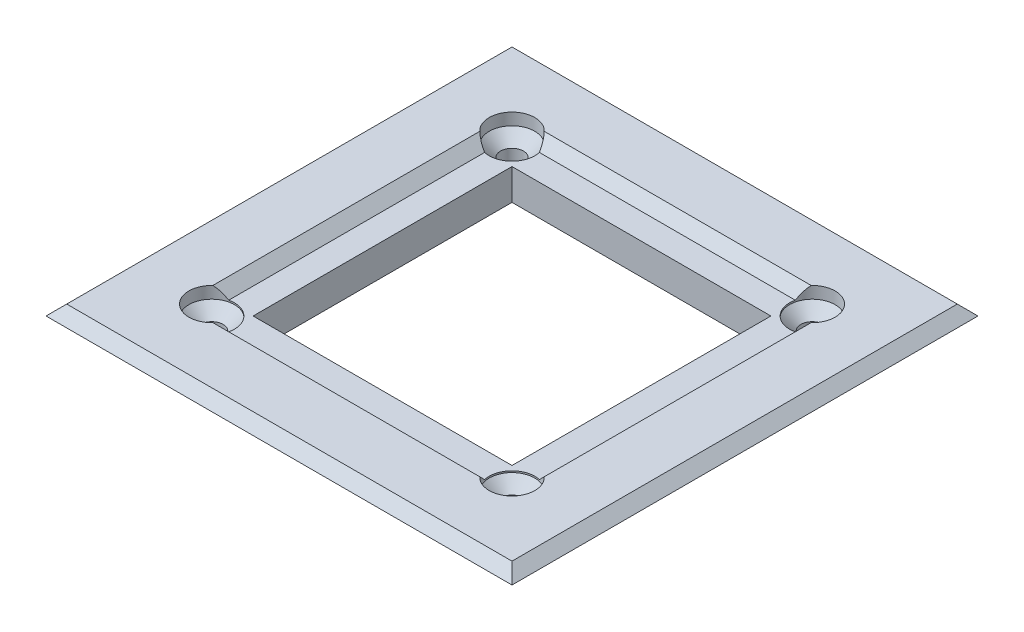
ISO-10303-21;
HEADER;
FILE_DESCRIPTION(('STEP AP214'),'2;1');
FILE_NAME('part.step','',(''),(''),'','','');
FILE_SCHEMA(('AUTOMOTIVE_DESIGN { 1 0 10303 214 1 1 1 1 }'));
ENDSEC;
DATA;
#1=APPLICATION_CONTEXT('core data for automotive mechanical design processes');
#2=APPLICATION_PROTOCOL_DEFINITION('international standard','automotive_design',2000,#1);
#3=PRODUCT_CONTEXT('',#1,'mechanical');
#4=PRODUCT('Part','Part','',(#3));
#5=PRODUCT_RELATED_PRODUCT_CATEGORY('part','',(#4));
#6=PRODUCT_DEFINITION_FORMATION('','',#4);
#7=PRODUCT_DEFINITION_CONTEXT('part definition',#1,'design');
#8=PRODUCT_DEFINITION('design','',#6,#7);
#9=PRODUCT_DEFINITION_SHAPE('','',#8);
#10=(LENGTH_UNIT() NAMED_UNIT(*) SI_UNIT(.MILLI.,.METRE.));
#11=(NAMED_UNIT(*) PLANE_ANGLE_UNIT() SI_UNIT($,.RADIAN.));
#12=(NAMED_UNIT(*) SI_UNIT($,.STERADIAN.) SOLID_ANGLE_UNIT());
#13=UNCERTAINTY_MEASURE_WITH_UNIT(LENGTH_MEASURE(1.E-05),#10,'distance_accuracy_value','');
#14=(GEOMETRIC_REPRESENTATION_CONTEXT(3) GLOBAL_UNCERTAINTY_ASSIGNED_CONTEXT((#13)) GLOBAL_UNIT_ASSIGNED_CONTEXT((#10,
#11,#12)) REPRESENTATION_CONTEXT('',''));
#15=CARTESIAN_POINT('',(0.,0.,0.));
#16=DIRECTION('',(0.,0.,1.));
#17=DIRECTION('',(1.,0.,0.));
#18=AXIS2_PLACEMENT_3D('',#15,#16,#17);
#19=CARTESIAN_POINT('',(0.,4.,0.));
#20=DIRECTION('',(0.,-1.,0.));
#21=DIRECTION('',(0.,0.,-1.));
#22=AXIS2_PLACEMENT_3D('',#19,#20,#21);
#23=PLANE('',#22);
#24=DIRECTION('',(0.,0.,1.));
#25=VECTOR('',#24,1.);
#26=CARTESIAN_POINT('',(-21.5,4.,0.));
#27=LINE('',#26,#25);
#28=CARTESIAN_POINT('',(-21.5,4.,-21.5));
#29=VERTEX_POINT('',#28);
#30=CARTESIAN_POINT('',(-21.5,4.,21.5));
#31=VERTEX_POINT('',#30);
#32=EDGE_CURVE('E50',#29,#31,#27,.T.);
#33=ORIENTED_EDGE('',*,*,#32,.T.);
#34=DIRECTION('',(1.,0.,0.));
#35=VECTOR('',#34,1.);
#36=CARTESIAN_POINT('',(0.,4.,21.5));
#37=LINE('',#36,#35);
#38=CARTESIAN_POINT('',(21.5,4.,21.5));
#39=VERTEX_POINT('',#38);
#40=EDGE_CURVE('E299',#31,#39,#37,.T.);
#41=ORIENTED_EDGE('',*,*,#40,.T.);
#42=DIRECTION('',(0.,0.,-1.));
#43=VECTOR('',#42,1.);
#44=CARTESIAN_POINT('',(21.5,4.,0.));
#45=LINE('',#44,#43);
#46=CARTESIAN_POINT('',(21.5,4.,-21.5));
#47=VERTEX_POINT('',#46);
#48=EDGE_CURVE('E295',#39,#47,#45,.T.);
#49=ORIENTED_EDGE('',*,*,#48,.T.);
#50=DIRECTION('',(-1.,0.,0.));
#51=VECTOR('',#50,1.);
#52=CARTESIAN_POINT('',(0.,4.,-21.5));
#53=LINE('',#52,#51);
#54=EDGE_CURVE('E55',#47,#29,#53,.T.);
#55=ORIENTED_EDGE('',*,*,#54,.T.);
#56=EDGE_LOOP('',(#33,#41,#49,#55));
#57=FACE_BOUND('',#56,.T.);
#58=CARTESIAN_POINT('',(-14.5,4.,-14.4999999999992));
#59=DIRECTION('',(0.,-1.,0.));
#60=DIRECTION('',(0.,0.,-1.));
#61=AXIS2_PLACEMENT_3D('',#58,#59,#60);
#62=CIRCLE('',#61,2.20000000000088);
#63=CARTESIAN_POINT('',(-12.8906523060565,4.,-16.));
#64=VERTEX_POINT('',#63);
#65=CARTESIAN_POINT('',(-16.,4.,-12.8906523060549));
#66=VERTEX_POINT('',#65);
#67=EDGE_CURVE('E179',#64,#66,#62,.F.);
#68=ORIENTED_EDGE('',*,*,#67,.F.);
#69=DIRECTION('',(1.,0.,0.));
#70=VECTOR('',#69,1.);
#71=CARTESIAN_POINT('',(15.,4.,-16.));
#72=LINE('',#71,#70);
#73=CARTESIAN_POINT('',(12.8906523060569,4.,-16.));
#74=VERTEX_POINT('',#73);
#75=EDGE_CURVE('E11',#64,#74,#72,.T.);
#76=ORIENTED_EDGE('',*,*,#75,.T.);
#77=CARTESIAN_POINT('',(14.5,4.,-14.5));
#78=DIRECTION('',(0.,-1.,0.));
#79=DIRECTION('',(0.,0.,-1.));
#80=AXIS2_PLACEMENT_3D('',#77,#78,#79);
#81=CIRCLE('',#80,2.2);
#82=CARTESIAN_POINT('',(16.,4.,-12.8906523060569));
#83=VERTEX_POINT('',#82);
#84=EDGE_CURVE('E698',#83,#74,#81,.F.);
#85=ORIENTED_EDGE('',*,*,#84,.F.);
#86=DIRECTION('',(0.,0.,1.));
#87=VECTOR('',#86,1.);
#88=CARTESIAN_POINT('',(16.,4.,15.));
#89=LINE('',#88,#87);
#90=CARTESIAN_POINT('',(16.,4.,12.8906523060564));
#91=VERTEX_POINT('',#90);
#92=EDGE_CURVE('E301',#83,#91,#89,.T.);
#93=ORIENTED_EDGE('',*,*,#92,.T.);
#94=CARTESIAN_POINT('',(14.5000000000008,4.,14.5));
#95=DIRECTION('',(0.,-1.,0.));
#96=DIRECTION('',(0.,0.,-1.));
#97=AXIS2_PLACEMENT_3D('',#94,#95,#96);
#98=CIRCLE('',#97,2.1999999999998);
#99=CARTESIAN_POINT('',(12.890652306058,4.,16.));
#100=VERTEX_POINT('',#99);
#101=EDGE_CURVE('E688',#100,#91,#98,.F.);
#102=ORIENTED_EDGE('',*,*,#101,.F.);
#103=DIRECTION('',(-1.,0.,0.));
#104=VECTOR('',#103,1.);
#105=CARTESIAN_POINT('',(-15.,4.,16.));
#106=LINE('',#105,#104);
#107=CARTESIAN_POINT('',(-12.8906523060545,4.,16.));
#108=VERTEX_POINT('',#107);
#109=EDGE_CURVE('E304',#100,#108,#106,.T.);
#110=ORIENTED_EDGE('',*,*,#109,.T.);
#111=CARTESIAN_POINT('',(-14.4999999999992,4.,14.5000000000008));
#112=DIRECTION('',(0.,-1.,0.));
#113=DIRECTION('',(0.,0.,-1.));
#114=AXIS2_PLACEMENT_3D('',#111,#112,#113);
#115=CIRCLE('',#114,2.2000000000006);
#116=CARTESIAN_POINT('',(-16.,4.,12.8906523060576));
#117=VERTEX_POINT('',#116);
#118=EDGE_CURVE('E691',#117,#108,#115,.F.);
#119=ORIENTED_EDGE('',*,*,#118,.F.);
#120=DIRECTION('',(0.,0.,-1.));
#121=VECTOR('',#120,1.);
#122=CARTESIAN_POINT('',(-16.,4.,-15.));
#123=LINE('',#122,#121);
#124=EDGE_CURVE('E42',#117,#66,#123,.T.);
#125=ORIENTED_EDGE('',*,*,#124,.T.);
#126=EDGE_LOOP('',(#68,#76,#85,#93,#102,#110,#119,#125));
#127=FACE_BOUND('',#126,.T.);
#128=ADVANCED_FACE('F33',(#57,#127),#23,.F.);
#129=CARTESIAN_POINT('',(-15.,2.99999999999999,15.));
#130=DIRECTION('',(0.707106781186547,0.707106781186547,0.));
#131=DIRECTION('',(0.,0.,-1.));
#132=AXIS2_PLACEMENT_3D('',#129,#130,#131);
#133=PLANE('',#132);
#134=DIRECTION('',(0.,0.,1.));
#135=VECTOR('',#134,1.);
#136=CARTESIAN_POINT('',(-15.,3.,15.));
#137=LINE('',#136,#135);
#138=CARTESIAN_POINT('',(-15.,3.,-12.3575714714373));
#139=VERTEX_POINT('',#138);
#140=CARTESIAN_POINT('',(-14.9999999999999,3.,12.3575714714375));
#141=VERTEX_POINT('',#140);
#142=EDGE_CURVE('E191',#139,#141,#137,.T.);
#143=ORIENTED_EDGE('',*,*,#142,.F.);
#144=CARTESIAN_POINT('',(-14.5,2.5,-14.4999999999992));
#145=DIRECTION('',(0.707106781186547,0.707106781186547,0.));
#146=DIRECTION('',(0.707106781186548,-0.707106781186548,0.));
#147=AXIS2_PLACEMENT_3D('',#144,#145,#146);
#148=ELLIPSE('',#147,3.11126983722205,2.20000000000088);
#149=EDGE_CURVE('E196',#139,#66,#148,.F.);
#150=ORIENTED_EDGE('',*,*,#149,.T.);
#151=ORIENTED_EDGE('',*,*,#124,.F.);
#152=CARTESIAN_POINT('',(-14.4999999999992,2.49999999999919,14.5000000000008));
#153=DIRECTION('',(0.707106781186547,0.707106781186547,0.));
#154=DIRECTION('',(0.707106781186548,-0.707106781186548,0.));
#155=AXIS2_PLACEMENT_3D('',#152,#153,#154);
#156=ELLIPSE('',#155,3.11126983722166,2.2000000000006);
#157=EDGE_CURVE('E737',#117,#141,#156,.F.);
#158=ORIENTED_EDGE('',*,*,#157,.T.);
#159=EDGE_LOOP('',(#143,#150,#151,#158));
#160=FACE_BOUND('',#159,.T.);
#161=ADVANCED_FACE('F359',(#160),#133,.T.);
#162=CARTESIAN_POINT('',(-15.,2.99999999999999,-15.));
#163=DIRECTION('',(0.,0.707106781186547,0.707106781186547));
#164=DIRECTION('',(1.,0.,0.));
#165=AXIS2_PLACEMENT_3D('',#162,#163,#164);
#166=PLANE('',#165);
#167=ORIENTED_EDGE('',*,*,#75,.F.);
#168=CARTESIAN_POINT('',(-14.5,2.49999999999918,-14.4999999999992));
#169=DIRECTION('',(0.,0.707106781186547,0.707106781186547));
#170=DIRECTION('',(0.,-0.707106781186548,0.707106781186548));
#171=AXIS2_PLACEMENT_3D('',#168,#169,#170);
#172=ELLIPSE('',#171,3.11126983722205,2.20000000000088);
#173=CARTESIAN_POINT('',(-12.3575714714365,3.,-15.0000000000001));
#174=VERTEX_POINT('',#173);
#175=EDGE_CURVE('E171',#64,#174,#172,.F.);
#176=ORIENTED_EDGE('',*,*,#175,.T.);
#177=DIRECTION('',(-1.,0.,0.));
#178=VECTOR('',#177,1.);
#179=CARTESIAN_POINT('',(-15.,3.,-15.));
#180=LINE('',#179,#178);
#181=CARTESIAN_POINT('',(12.3575714714371,3.,-15.));
#182=VERTEX_POINT('',#181);
#183=EDGE_CURVE('E175',#182,#174,#180,.T.);
#184=ORIENTED_EDGE('',*,*,#183,.F.);
#185=CARTESIAN_POINT('',(14.5,2.5,-14.5));
#186=DIRECTION('',(0.,0.707106781186547,0.707106781186547));
#187=DIRECTION('',(0.,-0.707106781186548,0.707106781186548));
#188=AXIS2_PLACEMENT_3D('',#185,#186,#187);
#189=ELLIPSE('',#188,3.11126983722081,2.2);
#190=EDGE_CURVE('E696',#182,#74,#189,.F.);
#191=ORIENTED_EDGE('',*,*,#190,.T.);
#192=EDGE_LOOP('',(#167,#176,#184,#191));
#193=FACE_BOUND('',#192,.T.);
#194=ADVANCED_FACE('F173',(#193),#166,.T.);
#195=CARTESIAN_POINT('',(-15.,2.99999999999999,15.));
#196=DIRECTION('',(0.,0.707106781186548,-0.707106781186547));
#197=DIRECTION('',(-1.,0.,0.));
#198=AXIS2_PLACEMENT_3D('',#195,#196,#197);
#199=PLANE('',#198);
#200=DIRECTION('',(1.,0.,0.));
#201=VECTOR('',#200,1.);
#202=CARTESIAN_POINT('',(-15.,3.,15.));
#203=LINE('',#202,#201);
#204=CARTESIAN_POINT('',(-12.3575714714373,3.,15.));
#205=VERTEX_POINT('',#204);
#206=CARTESIAN_POINT('',(12.3575714714381,3.,14.9999999999998));
#207=VERTEX_POINT('',#206);
#208=EDGE_CURVE('E215',#205,#207,#203,.T.);
#209=ORIENTED_EDGE('',*,*,#208,.F.);
#210=CARTESIAN_POINT('',(-14.4999999999992,2.5000000000008,14.5000000000008));
#211=DIRECTION('',(0.,0.707106781186548,-0.707106781186547));
#212=DIRECTION('',(0.,-0.707106781186547,-0.707106781186548));
#213=AXIS2_PLACEMENT_3D('',#210,#211,#212);
#214=ELLIPSE('',#213,3.11126983722166,2.2000000000006);
#215=EDGE_CURVE('E687',#205,#108,#214,.F.);
#216=ORIENTED_EDGE('',*,*,#215,.T.);
#217=ORIENTED_EDGE('',*,*,#109,.F.);
#218=CARTESIAN_POINT('',(14.5000000000008,2.49999999999999,14.5));
#219=DIRECTION('',(0.,0.707106781186548,-0.707106781186547));
#220=DIRECTION('',(0.,-0.707106781186547,-0.707106781186548));
#221=AXIS2_PLACEMENT_3D('',#218,#219,#220);
#222=ELLIPSE('',#221,3.11126983722052,2.1999999999998);
#223=EDGE_CURVE('E678',#100,#207,#222,.F.);
#224=ORIENTED_EDGE('',*,*,#223,.T.);
#225=EDGE_LOOP('',(#209,#216,#217,#224));
#226=FACE_BOUND('',#225,.T.);
#227=ADVANCED_FACE('F417',(#226),#199,.T.);
#228=CARTESIAN_POINT('',(15.,2.99999999999999,15.));
#229=DIRECTION('',(-0.707106781186547,0.707106781186547,0.));
#230=DIRECTION('',(0.,0.,1.));
#231=AXIS2_PLACEMENT_3D('',#228,#229,#230);
#232=PLANE('',#231);
#233=DIRECTION('',(0.,0.,-1.));
#234=VECTOR('',#233,1.);
#235=CARTESIAN_POINT('',(15.,3.,15.));
#236=LINE('',#235,#234);
#237=CARTESIAN_POINT('',(15.,3.,12.3575714714372));
#238=VERTEX_POINT('',#237);
#239=CARTESIAN_POINT('',(15.,3.,-12.3575714714371));
#240=VERTEX_POINT('',#239);
#241=EDGE_CURVE('E192',#238,#240,#236,.T.);
#242=ORIENTED_EDGE('',*,*,#241,.F.);
#243=CARTESIAN_POINT('',(14.5000000000008,2.5000000000008,14.5));
#244=DIRECTION('',(-0.707106781186547,0.707106781186547,0.));
#245=DIRECTION('',(-0.707106781186548,-0.707106781186548,0.));
#246=AXIS2_PLACEMENT_3D('',#243,#244,#245);
#247=ELLIPSE('',#246,3.11126983722052,2.1999999999998);
#248=EDGE_CURVE('E681',#238,#91,#247,.F.);
#249=ORIENTED_EDGE('',*,*,#248,.T.);
#250=ORIENTED_EDGE('',*,*,#92,.F.);
#251=CARTESIAN_POINT('',(14.5,2.49999999999999,-14.5));
#252=DIRECTION('',(-0.707106781186547,0.707106781186547,0.));
#253=DIRECTION('',(-0.707106781186548,-0.707106781186548,0.));
#254=AXIS2_PLACEMENT_3D('',#251,#252,#253);
#255=ELLIPSE('',#254,3.11126983722081,2.2);
#256=EDGE_CURVE('E701',#83,#240,#255,.F.);
#257=ORIENTED_EDGE('',*,*,#256,.T.);
#258=EDGE_LOOP('',(#242,#249,#250,#257));
#259=FACE_BOUND('',#258,.T.);
#260=ADVANCED_FACE('F396',(#259),#232,.T.);
#261=CARTESIAN_POINT('',(0.,3.,0.));
#262=DIRECTION('',(0.,-1.,0.));
#263=DIRECTION('',(0.,0.,-1.));
#264=AXIS2_PLACEMENT_3D('',#261,#262,#263);
#265=PLANE('',#264);
#266=DIRECTION('',(-1.,0.,0.));
#267=VECTOR('',#266,1.);
#268=CARTESIAN_POINT('',(-12.5,3.,-12.5));
#269=LINE('',#268,#267);
#270=CARTESIAN_POINT('',(12.5,3.,-12.5));
#271=VERTEX_POINT('',#270);
#272=CARTESIAN_POINT('',(-12.5,3.,-12.5));
#273=VERTEX_POINT('',#272);
#274=EDGE_CURVE('E246',#271,#273,#269,.T.);
#275=ORIENTED_EDGE('',*,*,#274,.F.);
#276=DIRECTION('',(0.,0.,-1.));
#277=VECTOR('',#276,1.);
#278=CARTESIAN_POINT('',(12.5,3.,12.5));
#279=LINE('',#278,#277);
#280=CARTESIAN_POINT('',(12.5,3.,12.5));
#281=VERTEX_POINT('',#280);
#282=EDGE_CURVE('E230',#281,#271,#279,.T.);
#283=ORIENTED_EDGE('',*,*,#282,.F.);
#284=DIRECTION('',(1.,0.,0.));
#285=VECTOR('',#284,1.);
#286=CARTESIAN_POINT('',(-12.5,3.,12.5));
#287=LINE('',#286,#285);
#288=CARTESIAN_POINT('',(-12.5,3.,12.5));
#289=VERTEX_POINT('',#288);
#290=EDGE_CURVE('E235',#289,#281,#287,.T.);
#291=ORIENTED_EDGE('',*,*,#290,.F.);
#292=DIRECTION('',(0.,0.,1.));
#293=VECTOR('',#292,1.);
#294=CARTESIAN_POINT('',(-12.5,3.,12.5));
#295=LINE('',#294,#293);
#296=EDGE_CURVE('E249',#273,#289,#295,.T.);
#297=ORIENTED_EDGE('',*,*,#296,.F.);
#298=EDGE_LOOP('',(#275,#283,#291,#297));
#299=FACE_BOUND('',#298,.T.);
#300=ORIENTED_EDGE('',*,*,#241,.T.);
#301=CARTESIAN_POINT('',(14.5,3.,-14.5));
#302=DIRECTION('',(0.,1.,0.));
#303=DIRECTION('',(0.,0.,1.));
#304=AXIS2_PLACEMENT_3D('',#301,#302,#303);
#305=CIRCLE('',#304,2.2);
#306=EDGE_CURVE('E190',#182,#240,#305,.T.);
#307=ORIENTED_EDGE('',*,*,#306,.F.);
#308=ORIENTED_EDGE('',*,*,#183,.T.);
#309=CARTESIAN_POINT('',(-14.4999999999998,3.,-14.5000000000002));
#310=DIRECTION('',(0.,1.,0.));
#311=DIRECTION('',(0.,0.,1.));
#312=AXIS2_PLACEMENT_3D('',#309,#310,#311);
#313=CIRCLE('',#312,2.2);
#314=EDGE_CURVE('E187',#139,#174,#313,.T.);
#315=ORIENTED_EDGE('',*,*,#314,.F.);
#316=ORIENTED_EDGE('',*,*,#142,.T.);
#317=CARTESIAN_POINT('',(-14.5000000000001,3.,14.4999999999999));
#318=DIRECTION('',(0.,1.,0.));
#319=DIRECTION('',(0.,0.,1.));
#320=AXIS2_PLACEMENT_3D('',#317,#318,#319);
#321=CIRCLE('',#320,2.2);
#322=EDGE_CURVE('E321',#205,#141,#321,.T.);
#323=ORIENTED_EDGE('',*,*,#322,.F.);
#324=ORIENTED_EDGE('',*,*,#208,.T.);
#325=CARTESIAN_POINT('',(14.5,3.,14.5));
#326=DIRECTION('',(0.,1.,0.));
#327=DIRECTION('',(0.,0.,1.));
#328=AXIS2_PLACEMENT_3D('',#325,#326,#327);
#329=CIRCLE('',#328,2.2);
#330=EDGE_CURVE('E334',#238,#207,#329,.T.);
#331=ORIENTED_EDGE('',*,*,#330,.F.);
#332=EDGE_LOOP('',(#300,#307,#308,#315,#316,#323,#324,#331));
#333=FACE_BOUND('',#332,.T.);
#334=ADVANCED_FACE('F185',(#299,#333),#265,.F.);
#335=CARTESIAN_POINT('',(17.5,3.,17.5));
#336=DIRECTION('',(-1.,0.,0.));
#337=DIRECTION('',(0.,0.,1.));
#338=AXIS2_PLACEMENT_3D('',#335,#336,#337);
#339=PLANE('',#338);
#340=DIRECTION('',(0.,0.,-1.));
#341=VECTOR('',#340,1.);
#342=CARTESIAN_POINT('',(17.5,0.,17.5));
#343=LINE('',#342,#341);
#344=CARTESIAN_POINT('',(17.5,0.,17.5));
#345=VERTEX_POINT('',#344);
#346=CARTESIAN_POINT('',(17.5,0.,-17.5));
#347=VERTEX_POINT('',#346);
#348=EDGE_CURVE('E256',#345,#347,#343,.T.);
#349=ORIENTED_EDGE('',*,*,#348,.T.);
#350=DIRECTION('',(0.,-1.,0.));
#351=VECTOR('',#350,1.);
#352=CARTESIAN_POINT('',(17.5,3.,-17.5));
#353=LINE('',#352,#351);
#354=CARTESIAN_POINT('',(17.5,3.,-17.5));
#355=VERTEX_POINT('',#354);
#356=EDGE_CURVE('E292',#355,#347,#353,.T.);
#357=ORIENTED_EDGE('',*,*,#356,.F.);
#358=DIRECTION('',(0.,0.,-1.));
#359=VECTOR('',#358,1.);
#360=CARTESIAN_POINT('',(17.5,3.,17.5));
#361=LINE('',#360,#359);
#362=CARTESIAN_POINT('',(17.5,3.,17.5));
#363=VERTEX_POINT('',#362);
#364=EDGE_CURVE('E263',#363,#355,#361,.T.);
#365=ORIENTED_EDGE('',*,*,#364,.F.);
#366=DIRECTION('',(0.,-1.,0.));
#367=VECTOR('',#366,1.);
#368=CARTESIAN_POINT('',(17.5,3.,17.5));
#369=LINE('',#368,#367);
#370=EDGE_CURVE('E276',#363,#345,#369,.T.);
#371=ORIENTED_EDGE('',*,*,#370,.T.);
#372=EDGE_LOOP('',(#349,#357,#365,#371));
#373=FACE_BOUND('',#372,.T.);
#374=ADVANCED_FACE('F395',(#373),#339,.F.);
#375=CARTESIAN_POINT('',(-17.5,3.,-17.5));
#376=DIRECTION('',(0.,0.,1.));
#377=DIRECTION('',(1.,0.,0.));
#378=AXIS2_PLACEMENT_3D('',#375,#376,#377);
#379=PLANE('',#378);
#380=DIRECTION('',(-1.,0.,0.));
#381=VECTOR('',#380,1.);
#382=CARTESIAN_POINT('',(-17.5,0.,-17.5));
#383=LINE('',#382,#381);
#384=CARTESIAN_POINT('',(-17.5,0.,-17.5));
#385=VERTEX_POINT('',#384);
#386=EDGE_CURVE('E279',#347,#385,#383,.T.);
#387=ORIENTED_EDGE('',*,*,#386,.T.);
#388=DIRECTION('',(0.,-1.,0.));
#389=VECTOR('',#388,1.);
#390=CARTESIAN_POINT('',(-17.5,3.,-17.5));
#391=LINE('',#390,#389);
#392=CARTESIAN_POINT('',(-17.5,3.,-17.5));
#393=VERTEX_POINT('',#392);
#394=EDGE_CURVE('E289',#393,#385,#391,.T.);
#395=ORIENTED_EDGE('',*,*,#394,.F.);
#396=DIRECTION('',(-1.,0.,0.));
#397=VECTOR('',#396,1.);
#398=CARTESIAN_POINT('',(-17.5,3.,-17.5));
#399=LINE('',#398,#397);
#400=EDGE_CURVE('E266',#355,#393,#399,.T.);
#401=ORIENTED_EDGE('',*,*,#400,.F.);
#402=ORIENTED_EDGE('',*,*,#356,.T.);
#403=EDGE_LOOP('',(#387,#395,#401,#402));
#404=FACE_BOUND('',#403,.T.);
#405=ADVANCED_FACE('F408',(#404),#379,.F.);
#406=CARTESIAN_POINT('',(-17.5,3.,17.5));
#407=DIRECTION('',(1.,0.,0.));
#408=DIRECTION('',(0.,0.,-1.));
#409=AXIS2_PLACEMENT_3D('',#406,#407,#408);
#410=PLANE('',#409);
#411=DIRECTION('',(0.,0.,1.));
#412=VECTOR('',#411,1.);
#413=CARTESIAN_POINT('',(-17.5,0.,17.5));
#414=LINE('',#413,#412);
#415=CARTESIAN_POINT('',(-17.5,0.,17.5));
#416=VERTEX_POINT('',#415);
#417=EDGE_CURVE('E281',#385,#416,#414,.T.);
#418=ORIENTED_EDGE('',*,*,#417,.T.);
#419=DIRECTION('',(0.,-1.,0.));
#420=VECTOR('',#419,1.);
#421=CARTESIAN_POINT('',(-17.5,3.,17.5));
#422=LINE('',#421,#420);
#423=CARTESIAN_POINT('',(-17.5,3.,17.5));
#424=VERTEX_POINT('',#423);
#425=EDGE_CURVE('E286',#424,#416,#422,.T.);
#426=ORIENTED_EDGE('',*,*,#425,.F.);
#427=DIRECTION('',(0.,0.,1.));
#428=VECTOR('',#427,1.);
#429=CARTESIAN_POINT('',(-17.5,3.,17.5));
#430=LINE('',#429,#428);
#431=EDGE_CURVE('E270',#393,#424,#430,.T.);
#432=ORIENTED_EDGE('',*,*,#431,.F.);
#433=ORIENTED_EDGE('',*,*,#394,.T.);
#434=EDGE_LOOP('',(#418,#426,#432,#433));
#435=FACE_BOUND('',#434,.T.);
#436=ADVANCED_FACE('F404',(#435),#410,.F.);
#437=CARTESIAN_POINT('',(-17.5,3.,17.5));
#438=DIRECTION('',(0.,0.,-1.));
#439=DIRECTION('',(-1.,0.,0.));
#440=AXIS2_PLACEMENT_3D('',#437,#438,#439);
#441=PLANE('',#440);
#442=DIRECTION('',(1.,0.,0.));
#443=VECTOR('',#442,1.);
#444=CARTESIAN_POINT('',(-17.5,0.,17.5));
#445=LINE('',#444,#443);
#446=EDGE_CURVE('E267',#416,#345,#445,.T.);
#447=ORIENTED_EDGE('',*,*,#446,.T.);
#448=ORIENTED_EDGE('',*,*,#370,.F.);
#449=DIRECTION('',(1.,0.,0.));
#450=VECTOR('',#449,1.);
#451=CARTESIAN_POINT('',(-17.5,3.,17.5));
#452=LINE('',#451,#450);
#453=EDGE_CURVE('E273',#424,#363,#452,.T.);
#454=ORIENTED_EDGE('',*,*,#453,.F.);
#455=ORIENTED_EDGE('',*,*,#425,.T.);
#456=EDGE_LOOP('',(#447,#448,#454,#455));
#457=FACE_BOUND('',#456,.T.);
#458=ADVANCED_FACE('F400',(#457),#441,.F.);
#459=CARTESIAN_POINT('',(0.,0.,0.));
#460=DIRECTION('',(0.,-1.,0.));
#461=DIRECTION('',(0.,0.,-1.));
#462=AXIS2_PLACEMENT_3D('',#459,#460,#461);
#463=PLANE('',#462);
#464=CARTESIAN_POINT('',(14.5,0.,-14.5));
#465=DIRECTION('',(0.,-1.,0.));
#466=DIRECTION('',(0.,0.,-1.));
#467=AXIS2_PLACEMENT_3D('',#464,#465,#466);
#468=CIRCLE('',#467,1.1);
#469=CARTESIAN_POINT('',(14.5,0.,-15.6));
#470=VERTEX_POINT('',#469);
#471=EDGE_CURVE('E37',#470,#470,#468,.T.);
#472=ORIENTED_EDGE('',*,*,#471,.F.);
#473=EDGE_LOOP('',(#472));
#474=FACE_BOUND('',#473,.T.);
#475=CARTESIAN_POINT('',(14.5,0.,14.5));
#476=DIRECTION('',(0.,-1.,0.));
#477=DIRECTION('',(0.,0.,-1.));
#478=AXIS2_PLACEMENT_3D('',#475,#476,#477);
#479=CIRCLE('',#478,1.1);
#480=CARTESIAN_POINT('',(14.5,0.,13.4000000000001));
#481=VERTEX_POINT('',#480);
#482=EDGE_CURVE('E319',#481,#481,#479,.T.);
#483=ORIENTED_EDGE('',*,*,#482,.F.);
#484=EDGE_LOOP('',(#483));
#485=FACE_BOUND('',#484,.T.);
#486=CARTESIAN_POINT('',(-14.5000000000001,0.,14.4999999999999));
#487=DIRECTION('',(0.,-1.,0.));
#488=DIRECTION('',(0.,0.,-1.));
#489=AXIS2_PLACEMENT_3D('',#486,#487,#488);
#490=CIRCLE('',#489,1.1);
#491=CARTESIAN_POINT('',(-14.5000000000001,0.,13.3999999999999));
#492=VERTEX_POINT('',#491);
#493=EDGE_CURVE('E198',#492,#492,#490,.T.);
#494=ORIENTED_EDGE('',*,*,#493,.F.);
#495=EDGE_LOOP('',(#494));
#496=FACE_BOUND('',#495,.T.);
#497=CARTESIAN_POINT('',(-14.4999999999998,0.,-14.5000000000002));
#498=DIRECTION('',(0.,-1.,0.));
#499=DIRECTION('',(0.,0.,-1.));
#500=AXIS2_PLACEMENT_3D('',#497,#498,#499);
#501=CIRCLE('',#500,1.1);
#502=CARTESIAN_POINT('',(-14.4999999999998,0.,-15.6000000000002));
#503=VERTEX_POINT('',#502);
#504=EDGE_CURVE('E211',#503,#503,#501,.T.);
#505=ORIENTED_EDGE('',*,*,#504,.F.);
#506=EDGE_LOOP('',(#505));
#507=FACE_BOUND('',#506,.T.);
#508=DIRECTION('',(0.,0.,-1.));
#509=VECTOR('',#508,1.);
#510=CARTESIAN_POINT('',(12.5,0.,12.5));
#511=LINE('',#510,#509);
#512=CARTESIAN_POINT('',(12.5,0.,12.5));
#513=VERTEX_POINT('',#512);
#514=CARTESIAN_POINT('',(12.5,0.,-12.5));
#515=VERTEX_POINT('',#514);
#516=EDGE_CURVE('E231',#513,#515,#511,.T.);
#517=ORIENTED_EDGE('',*,*,#516,.T.);
#518=DIRECTION('',(-1.,0.,0.));
#519=VECTOR('',#518,1.);
#520=CARTESIAN_POINT('',(-12.5,0.,-12.5));
#521=LINE('',#520,#519);
#522=CARTESIAN_POINT('',(-12.5,0.,-12.5));
#523=VERTEX_POINT('',#522);
#524=EDGE_CURVE('E234',#515,#523,#521,.T.);
#525=ORIENTED_EDGE('',*,*,#524,.T.);
#526=DIRECTION('',(0.,0.,1.));
#527=VECTOR('',#526,1.);
#528=CARTESIAN_POINT('',(-12.5,0.,12.5));
#529=LINE('',#528,#527);
#530=CARTESIAN_POINT('',(-12.5,0.,12.5));
#531=VERTEX_POINT('',#530);
#532=EDGE_CURVE('E238',#523,#531,#529,.T.);
#533=ORIENTED_EDGE('',*,*,#532,.T.);
#534=DIRECTION('',(1.,0.,0.));
#535=VECTOR('',#534,1.);
#536=CARTESIAN_POINT('',(-12.5,0.,12.5));
#537=LINE('',#536,#535);
#538=EDGE_CURVE('E241',#531,#513,#537,.T.);
#539=ORIENTED_EDGE('',*,*,#538,.T.);
#540=EDGE_LOOP('',(#517,#525,#533,#539));
#541=FACE_BOUND('',#540,.T.);
#542=ORIENTED_EDGE('',*,*,#348,.F.);
#543=ORIENTED_EDGE('',*,*,#446,.F.);
#544=ORIENTED_EDGE('',*,*,#417,.F.);
#545=ORIENTED_EDGE('',*,*,#386,.F.);
#546=EDGE_LOOP('',(#542,#543,#544,#545));
#547=FACE_BOUND('',#546,.T.);
#548=ADVANCED_FACE('F391',(#474,#485,#496,#507,#541,#547),#463,.T.);
#549=CARTESIAN_POINT('',(12.5,0.,12.5));
#550=DIRECTION('',(1.,0.,0.));
#551=DIRECTION('',(0.,0.,-1.));
#552=AXIS2_PLACEMENT_3D('',#549,#550,#551);
#553=PLANE('',#552);
#554=ORIENTED_EDGE('',*,*,#282,.T.);
#555=DIRECTION('',(0.,1.,0.));
#556=VECTOR('',#555,1.);
#557=CARTESIAN_POINT('',(12.5,0.,-12.5));
#558=LINE('',#557,#556);
#559=EDGE_CURVE('E244',#515,#271,#558,.T.);
#560=ORIENTED_EDGE('',*,*,#559,.F.);
#561=ORIENTED_EDGE('',*,*,#516,.F.);
#562=DIRECTION('',(0.,1.,0.));
#563=VECTOR('',#562,1.);
#564=CARTESIAN_POINT('',(12.5,0.,12.5));
#565=LINE('',#564,#563);
#566=EDGE_CURVE('E254',#513,#281,#565,.T.);
#567=ORIENTED_EDGE('',*,*,#566,.T.);
#568=EDGE_LOOP('',(#554,#560,#561,#567));
#569=FACE_BOUND('',#568,.T.);
#570=ADVANCED_FACE('F381',(#569),#553,.F.);
#571=CARTESIAN_POINT('',(-12.5,0.,12.5));
#572=DIRECTION('',(0.,0.,1.));
#573=DIRECTION('',(1.,0.,0.));
#574=AXIS2_PLACEMENT_3D('',#571,#572,#573);
#575=PLANE('',#574);
#576=ORIENTED_EDGE('',*,*,#290,.T.);
#577=ORIENTED_EDGE('',*,*,#566,.F.);
#578=ORIENTED_EDGE('',*,*,#538,.F.);
#579=DIRECTION('',(0.,1.,0.));
#580=VECTOR('',#579,1.);
#581=CARTESIAN_POINT('',(-12.5,0.,12.5));
#582=LINE('',#581,#580);
#583=EDGE_CURVE('E257',#531,#289,#582,.T.);
#584=ORIENTED_EDGE('',*,*,#583,.T.);
#585=EDGE_LOOP('',(#576,#577,#578,#584));
#586=FACE_BOUND('',#585,.T.);
#587=ADVANCED_FACE('F377',(#586),#575,.F.);
#588=CARTESIAN_POINT('',(-12.5,0.,12.5));
#589=DIRECTION('',(-1.,0.,0.));
#590=DIRECTION('',(0.,0.,1.));
#591=AXIS2_PLACEMENT_3D('',#588,#589,#590);
#592=PLANE('',#591);
#593=ORIENTED_EDGE('',*,*,#296,.T.);
#594=ORIENTED_EDGE('',*,*,#583,.F.);
#595=ORIENTED_EDGE('',*,*,#532,.F.);
#596=DIRECTION('',(0.,1.,0.));
#597=VECTOR('',#596,1.);
#598=CARTESIAN_POINT('',(-12.5,0.,-12.5));
#599=LINE('',#598,#597);
#600=EDGE_CURVE('E259',#523,#273,#599,.T.);
#601=ORIENTED_EDGE('',*,*,#600,.T.);
#602=EDGE_LOOP('',(#593,#594,#595,#601));
#603=FACE_BOUND('',#602,.T.);
#604=ADVANCED_FACE('F380',(#603),#592,.F.);
#605=CARTESIAN_POINT('',(-12.5,0.,-12.5));
#606=DIRECTION('',(0.,0.,-1.));
#607=DIRECTION('',(-1.,0.,0.));
#608=AXIS2_PLACEMENT_3D('',#605,#606,#607);
#609=PLANE('',#608);
#610=ORIENTED_EDGE('',*,*,#274,.T.);
#611=ORIENTED_EDGE('',*,*,#600,.F.);
#612=ORIENTED_EDGE('',*,*,#524,.F.);
#613=ORIENTED_EDGE('',*,*,#559,.T.);
#614=EDGE_LOOP('',(#610,#611,#612,#613));
#615=FACE_BOUND('',#614,.T.);
#616=ADVANCED_FACE('F375',(#615),#609,.F.);
#617=CARTESIAN_POINT('',(0.,3.,0.));
#618=DIRECTION('',(0.,-1.,0.));
#619=DIRECTION('',(0.,0.,-1.));
#620=AXIS2_PLACEMENT_3D('',#617,#618,#619);
#621=PLANE('',#620);
#622=DIRECTION('',(0.,0.,-1.));
#623=VECTOR('',#622,1.);
#624=CARTESIAN_POINT('',(22.5,3.,22.5));
#625=LINE('',#624,#623);
#626=CARTESIAN_POINT('',(22.5,3.,22.5));
#627=VERTEX_POINT('',#626);
#628=CARTESIAN_POINT('',(22.5,3.,-22.5));
#629=VERTEX_POINT('',#628);
#630=EDGE_CURVE('E218',#627,#629,#625,.T.);
#631=ORIENTED_EDGE('',*,*,#630,.F.);
#632=DIRECTION('',(1.,0.,0.));
#633=VECTOR('',#632,1.);
#634=CARTESIAN_POINT('',(-22.5,3.,22.5));
#635=LINE('',#634,#633);
#636=CARTESIAN_POINT('',(-22.5,3.,22.5));
#637=VERTEX_POINT('',#636);
#638=EDGE_CURVE('E227',#637,#627,#635,.T.);
#639=ORIENTED_EDGE('',*,*,#638,.F.);
#640=DIRECTION('',(0.,0.,1.));
#641=VECTOR('',#640,1.);
#642=CARTESIAN_POINT('',(-22.5,3.,22.5));
#643=LINE('',#642,#641);
#644=CARTESIAN_POINT('',(-22.5,3.,-22.5));
#645=VERTEX_POINT('',#644);
#646=EDGE_CURVE('E224',#645,#637,#643,.T.);
#647=ORIENTED_EDGE('',*,*,#646,.F.);
#648=DIRECTION('',(-1.,0.,0.));
#649=VECTOR('',#648,1.);
#650=CARTESIAN_POINT('',(-22.5,3.,-22.5));
#651=LINE('',#650,#649);
#652=EDGE_CURVE('E221',#629,#645,#651,.T.);
#653=ORIENTED_EDGE('',*,*,#652,.F.);
#654=EDGE_LOOP('',(#631,#639,#647,#653));
#655=FACE_BOUND('',#654,.T.);
#656=ORIENTED_EDGE('',*,*,#364,.T.);
#657=ORIENTED_EDGE('',*,*,#400,.T.);
#658=ORIENTED_EDGE('',*,*,#431,.T.);
#659=ORIENTED_EDGE('',*,*,#453,.T.);
#660=EDGE_LOOP('',(#656,#657,#658,#659));
#661=FACE_BOUND('',#660,.T.);
#662=ADVANCED_FACE('F372',(#655,#661),#621,.T.);
#663=CARTESIAN_POINT('',(0.,4.,-21.5));
#664=DIRECTION('',(0.,-0.707106781186547,0.707106781186547));
#665=DIRECTION('',(-1.,0.,0.));
#666=AXIS2_PLACEMENT_3D('',#663,#664,#665);
#667=PLANE('',#666);
#668=DIRECTION('',(-0.577350269189626,0.577350269189626,0.577350269189626));
#669=VECTOR('',#668,1.);
#670=CARTESIAN_POINT('',(14.3333333333333,11.1666666666667,-14.3333333333333));
#671=LINE('',#670,#669);
#672=EDGE_CURVE('E313',#629,#47,#671,.T.);
#673=ORIENTED_EDGE('',*,*,#672,.F.);
#674=ORIENTED_EDGE('',*,*,#652,.T.);
#675=DIRECTION('',(0.577350269189626,0.577350269189626,0.577350269189626));
#676=VECTOR('',#675,1.);
#677=CARTESIAN_POINT('',(-14.3333333333333,11.1666666666667,-14.3333333333333));
#678=LINE('',#677,#676);
#679=EDGE_CURVE('E212',#29,#645,#678,.F.);
#680=ORIENTED_EDGE('',*,*,#679,.F.);
#681=ORIENTED_EDGE('',*,*,#54,.F.);
#682=EDGE_LOOP('',(#673,#674,#680,#681));
#683=FACE_BOUND('',#682,.T.);
#684=ADVANCED_FACE('F35',(#683),#667,.F.);
#685=CARTESIAN_POINT('',(-21.5,4.,0.));
#686=DIRECTION('',(0.707106781186547,-0.707106781186547,0.));
#687=DIRECTION('',(0.,0.,1.));
#688=AXIS2_PLACEMENT_3D('',#685,#686,#687);
#689=PLANE('',#688);
#690=ORIENTED_EDGE('',*,*,#679,.T.);
#691=ORIENTED_EDGE('',*,*,#646,.T.);
#692=DIRECTION('',(0.577350269189626,0.577350269189626,-0.577350269189626));
#693=VECTOR('',#692,1.);
#694=CARTESIAN_POINT('',(-14.3333333333333,11.1666666666667,14.3333333333333));
#695=LINE('',#694,#693);
#696=EDGE_CURVE('E311',#31,#637,#695,.F.);
#697=ORIENTED_EDGE('',*,*,#696,.F.);
#698=ORIENTED_EDGE('',*,*,#32,.F.);
#699=EDGE_LOOP('',(#690,#691,#697,#698));
#700=FACE_BOUND('',#699,.T.);
#701=ADVANCED_FACE('F431',(#700),#689,.F.);
#702=CARTESIAN_POINT('',(21.5,4.,0.));
#703=DIRECTION('',(-0.707106781186547,-0.707106781186547,0.));
#704=DIRECTION('',(0.,0.,-1.));
#705=AXIS2_PLACEMENT_3D('',#702,#703,#704);
#706=PLANE('',#705);
#707=ORIENTED_EDGE('',*,*,#672,.T.);
#708=ORIENTED_EDGE('',*,*,#48,.F.);
#709=DIRECTION('',(0.577350269189626,-0.577350269189626,0.577350269189626));
#710=VECTOR('',#709,1.);
#711=CARTESIAN_POINT('',(14.3333333333333,11.1666666666667,14.3333333333333));
#712=LINE('',#711,#710);
#713=EDGE_CURVE('E309',#627,#39,#712,.F.);
#714=ORIENTED_EDGE('',*,*,#713,.F.);
#715=ORIENTED_EDGE('',*,*,#630,.T.);
#716=EDGE_LOOP('',(#707,#708,#714,#715));
#717=FACE_BOUND('',#716,.T.);
#718=ADVANCED_FACE('F428',(#717),#706,.F.);
#719=CARTESIAN_POINT('',(0.,4.,21.5));
#720=DIRECTION('',(0.,-0.707106781186547,-0.707106781186547));
#721=DIRECTION('',(1.,0.,0.));
#722=AXIS2_PLACEMENT_3D('',#719,#720,#721);
#723=PLANE('',#722);
#724=ORIENTED_EDGE('',*,*,#696,.T.);
#725=ORIENTED_EDGE('',*,*,#638,.T.);
#726=ORIENTED_EDGE('',*,*,#713,.T.);
#727=ORIENTED_EDGE('',*,*,#40,.F.);
#728=EDGE_LOOP('',(#724,#725,#726,#727));
#729=FACE_BOUND('',#728,.T.);
#730=ADVANCED_FACE('F425',(#729),#723,.F.);
#731=CARTESIAN_POINT('',(-14.4999999999998,3.,-14.5000000000002));
#732=DIRECTION('',(0.,1.,0.));
#733=DIRECTION('',(0.,0.,1.));
#734=AXIS2_PLACEMENT_3D('',#731,#732,#733);
#735=CYLINDRICAL_SURFACE('',#734,1.1);
#736=ORIENTED_EDGE('',*,*,#504,.T.);
#737=EDGE_LOOP('',(#736));
#738=FACE_BOUND('',#737,.T.);
#739=CARTESIAN_POINT('',(-14.4999999999998,1.75,-14.5000000000002));
#740=DIRECTION('',(0.,1.,0.));
#741=DIRECTION('',(0.,0.,1.));
#742=AXIS2_PLACEMENT_3D('',#739,#740,#741);
#743=CIRCLE('',#742,1.1);
#744=CARTESIAN_POINT('',(-14.4999999999998,1.75,-13.4000000000001));
#745=VERTEX_POINT('',#744);
#746=EDGE_CURVE('E201',#745,#745,#743,.T.);
#747=ORIENTED_EDGE('',*,*,#746,.T.);
#748=EDGE_LOOP('',(#747));
#749=FACE_BOUND('',#748,.T.);
#750=ADVANCED_FACE('F370',(#738,#749),#735,.F.);
#751=CARTESIAN_POINT('',(-14.4999999999998,2.85,-14.5000000000002));
#752=DIRECTION('',(0.,1.,0.));
#753=DIRECTION('',(0.,0.,1.));
#754=AXIS2_PLACEMENT_3D('',#751,#752,#753);
#755=CONICAL_SURFACE('',#754,2.2,0.785398163397447);
#756=ORIENTED_EDGE('',*,*,#746,.F.);
#757=EDGE_LOOP('',(#756));
#758=FACE_BOUND('',#757,.T.);
#759=CARTESIAN_POINT('',(-14.4999999999998,2.85,-14.5000000000002));
#760=DIRECTION('',(0.,1.,0.));
#761=DIRECTION('',(0.,0.,1.));
#762=AXIS2_PLACEMENT_3D('',#759,#760,#761);
#763=CIRCLE('',#762,2.2);
#764=CARTESIAN_POINT('',(-14.4999999999998,2.85,-12.3000000000002));
#765=VERTEX_POINT('',#764);
#766=EDGE_CURVE('E197',#765,#765,#763,.T.);
#767=ORIENTED_EDGE('',*,*,#766,.T.);
#768=EDGE_LOOP('',(#767));
#769=FACE_BOUND('',#768,.T.);
#770=ADVANCED_FACE('F518',(#758,#769),#755,.F.);
#771=CARTESIAN_POINT('',(-14.4999999999998,3.,-14.5000000000002));
#772=DIRECTION('',(0.,1.,0.));
#773=DIRECTION('',(0.,0.,1.));
#774=AXIS2_PLACEMENT_3D('',#771,#772,#773);
#775=CYLINDRICAL_SURFACE('',#774,2.2);
#776=ORIENTED_EDGE('',*,*,#766,.F.);
#777=EDGE_LOOP('',(#776));
#778=FACE_BOUND('',#777,.T.);
#779=ORIENTED_EDGE('',*,*,#314,.T.);
#780=ORIENTED_EDGE('',*,*,#175,.F.);
#781=ORIENTED_EDGE('',*,*,#67,.T.);
#782=ORIENTED_EDGE('',*,*,#149,.F.);
#783=EDGE_LOOP('',(#779,#780,#781,#782));
#784=FACE_BOUND('',#783,.T.);
#785=ADVANCED_FACE('F194',(#778,#784),#775,.F.);
#786=CARTESIAN_POINT('',(-14.5000000000001,3.,14.4999999999999));
#787=DIRECTION('',(0.,1.,0.));
#788=DIRECTION('',(0.,0.,1.));
#789=AXIS2_PLACEMENT_3D('',#786,#787,#788);
#790=CYLINDRICAL_SURFACE('',#789,1.1);
#791=ORIENTED_EDGE('',*,*,#493,.T.);
#792=EDGE_LOOP('',(#791));
#793=FACE_BOUND('',#792,.T.);
#794=CARTESIAN_POINT('',(-14.5000000000001,1.75,14.4999999999999));
#795=DIRECTION('',(0.,1.,0.));
#796=DIRECTION('',(0.,0.,1.));
#797=AXIS2_PLACEMENT_3D('',#794,#795,#796);
#798=CIRCLE('',#797,1.1);
#799=CARTESIAN_POINT('',(-14.5000000000001,1.75,15.5999999999999));
#800=VERTEX_POINT('',#799);
#801=EDGE_CURVE('E204',#800,#800,#798,.T.);
#802=ORIENTED_EDGE('',*,*,#801,.T.);
#803=EDGE_LOOP('',(#802));
#804=FACE_BOUND('',#803,.T.);
#805=ADVANCED_FACE('F343',(#793,#804),#790,.F.);
#806=CARTESIAN_POINT('',(-14.5000000000001,2.85,14.4999999999999));
#807=DIRECTION('',(0.,1.,0.));
#808=DIRECTION('',(0.,0.,1.));
#809=AXIS2_PLACEMENT_3D('',#806,#807,#808);
#810=CONICAL_SURFACE('',#809,2.2,0.785398163397447);
#811=ORIENTED_EDGE('',*,*,#801,.F.);
#812=EDGE_LOOP('',(#811));
#813=FACE_BOUND('',#812,.T.);
#814=CARTESIAN_POINT('',(-14.5000000000001,2.85,14.4999999999999));
#815=DIRECTION('',(0.,1.,0.));
#816=DIRECTION('',(0.,0.,1.));
#817=AXIS2_PLACEMENT_3D('',#814,#815,#816);
#818=CIRCLE('',#817,2.2);
#819=CARTESIAN_POINT('',(-14.5000000000001,2.85,16.6999999999999));
#820=VERTEX_POINT('',#819);
#821=EDGE_CURVE('E326',#820,#820,#818,.T.);
#822=ORIENTED_EDGE('',*,*,#821,.T.);
#823=EDGE_LOOP('',(#822));
#824=FACE_BOUND('',#823,.T.);
#825=ADVANCED_FACE('F345',(#813,#824),#810,.F.);
#826=CARTESIAN_POINT('',(-14.5000000000001,3.,14.4999999999999));
#827=DIRECTION('',(0.,1.,0.));
#828=DIRECTION('',(0.,0.,1.));
#829=AXIS2_PLACEMENT_3D('',#826,#827,#828);
#830=CYLINDRICAL_SURFACE('',#829,2.2);
#831=ORIENTED_EDGE('',*,*,#821,.F.);
#832=EDGE_LOOP('',(#831));
#833=FACE_BOUND('',#832,.T.);
#834=ORIENTED_EDGE('',*,*,#322,.T.);
#835=ORIENTED_EDGE('',*,*,#157,.F.);
#836=ORIENTED_EDGE('',*,*,#118,.T.);
#837=ORIENTED_EDGE('',*,*,#215,.F.);
#838=EDGE_LOOP('',(#834,#835,#836,#837));
#839=FACE_BOUND('',#838,.T.);
#840=ADVANCED_FACE('F347',(#833,#839),#830,.F.);
#841=CARTESIAN_POINT('',(14.5,3.,14.5));
#842=DIRECTION('',(0.,1.,0.));
#843=DIRECTION('',(0.,0.,1.));
#844=AXIS2_PLACEMENT_3D('',#841,#842,#843);
#845=CYLINDRICAL_SURFACE('',#844,1.1);
#846=ORIENTED_EDGE('',*,*,#482,.T.);
#847=EDGE_LOOP('',(#846));
#848=FACE_BOUND('',#847,.T.);
#849=CARTESIAN_POINT('',(14.5,1.75,14.5));
#850=DIRECTION('',(0.,1.,0.));
#851=DIRECTION('',(0.,0.,1.));
#852=AXIS2_PLACEMENT_3D('',#849,#850,#851);
#853=CIRCLE('',#852,1.1);
#854=CARTESIAN_POINT('',(14.5,1.75,15.6000000000001));
#855=VERTEX_POINT('',#854);
#856=EDGE_CURVE('E322',#855,#855,#853,.T.);
#857=ORIENTED_EDGE('',*,*,#856,.T.);
#858=EDGE_LOOP('',(#857));
#859=FACE_BOUND('',#858,.T.);
#860=ADVANCED_FACE('F353',(#848,#859),#845,.F.);
#861=CARTESIAN_POINT('',(14.5,2.85,14.5));
#862=DIRECTION('',(0.,1.,0.));
#863=DIRECTION('',(0.,0.,1.));
#864=AXIS2_PLACEMENT_3D('',#861,#862,#863);
#865=CONICAL_SURFACE('',#864,2.2,0.785398163397447);
#866=ORIENTED_EDGE('',*,*,#856,.F.);
#867=EDGE_LOOP('',(#866));
#868=FACE_BOUND('',#867,.T.);
#869=CARTESIAN_POINT('',(14.5,2.85,14.5));
#870=DIRECTION('',(0.,1.,0.));
#871=DIRECTION('',(0.,0.,1.));
#872=AXIS2_PLACEMENT_3D('',#869,#870,#871);
#873=CIRCLE('',#872,2.2);
#874=CARTESIAN_POINT('',(14.5,2.85,16.7));
#875=VERTEX_POINT('',#874);
#876=EDGE_CURVE('E329',#875,#875,#873,.T.);
#877=ORIENTED_EDGE('',*,*,#876,.T.);
#878=EDGE_LOOP('',(#877));
#879=FACE_BOUND('',#878,.T.);
#880=ADVANCED_FACE('F549',(#868,#879),#865,.F.);
#881=CARTESIAN_POINT('',(14.5,3.,14.5));
#882=DIRECTION('',(0.,1.,0.));
#883=DIRECTION('',(0.,0.,1.));
#884=AXIS2_PLACEMENT_3D('',#881,#882,#883);
#885=CYLINDRICAL_SURFACE('',#884,2.2);
#886=ORIENTED_EDGE('',*,*,#876,.F.);
#887=EDGE_LOOP('',(#886));
#888=FACE_BOUND('',#887,.T.);
#889=ORIENTED_EDGE('',*,*,#330,.T.);
#890=ORIENTED_EDGE('',*,*,#223,.F.);
#891=ORIENTED_EDGE('',*,*,#101,.T.);
#892=ORIENTED_EDGE('',*,*,#248,.F.);
#893=EDGE_LOOP('',(#889,#890,#891,#892));
#894=FACE_BOUND('',#893,.T.);
#895=ADVANCED_FACE('F558',(#888,#894),#885,.F.);
#896=CARTESIAN_POINT('',(14.5,3.,-14.5));
#897=DIRECTION('',(0.,1.,0.));
#898=DIRECTION('',(0.,0.,1.));
#899=AXIS2_PLACEMENT_3D('',#896,#897,#898);
#900=CYLINDRICAL_SURFACE('',#899,1.1);
#901=ORIENTED_EDGE('',*,*,#471,.T.);
#902=EDGE_LOOP('',(#901));
#903=FACE_BOUND('',#902,.T.);
#904=CARTESIAN_POINT('',(14.5,1.75,-14.5));
#905=DIRECTION('',(0.,1.,0.));
#906=DIRECTION('',(0.,0.,1.));
#907=AXIS2_PLACEMENT_3D('',#904,#905,#906);
#908=CIRCLE('',#907,1.1);
#909=CARTESIAN_POINT('',(14.5,1.75,-13.4));
#910=VERTEX_POINT('',#909);
#911=EDGE_CURVE('E707',#910,#910,#908,.T.);
#912=ORIENTED_EDGE('',*,*,#911,.T.);
#913=EDGE_LOOP('',(#912));
#914=FACE_BOUND('',#913,.T.);
#915=ADVANCED_FACE('F566',(#903,#914),#900,.F.);
#916=CARTESIAN_POINT('',(14.5,2.85,-14.5));
#917=DIRECTION('',(0.,1.,0.));
#918=DIRECTION('',(0.,0.,1.));
#919=AXIS2_PLACEMENT_3D('',#916,#917,#918);
#920=CONICAL_SURFACE('',#919,2.2,0.785398163397447);
#921=ORIENTED_EDGE('',*,*,#911,.F.);
#922=EDGE_LOOP('',(#921));
#923=FACE_BOUND('',#922,.T.);
#924=CARTESIAN_POINT('',(14.5,2.85,-14.5));
#925=DIRECTION('',(0.,1.,0.));
#926=DIRECTION('',(0.,0.,1.));
#927=AXIS2_PLACEMENT_3D('',#924,#925,#926);
#928=CIRCLE('',#927,2.2);
#929=CARTESIAN_POINT('',(14.5,2.85,-12.3));
#930=VERTEX_POINT('',#929);
#931=EDGE_CURVE('E704',#930,#930,#928,.T.);
#932=ORIENTED_EDGE('',*,*,#931,.T.);
#933=EDGE_LOOP('',(#932));
#934=FACE_BOUND('',#933,.T.);
#935=ADVANCED_FACE('F570',(#923,#934),#920,.F.);
#936=CARTESIAN_POINT('',(14.5,3.,-14.5));
#937=DIRECTION('',(0.,1.,0.));
#938=DIRECTION('',(0.,0.,1.));
#939=AXIS2_PLACEMENT_3D('',#936,#937,#938);
#940=CYLINDRICAL_SURFACE('',#939,2.2);
#941=ORIENTED_EDGE('',*,*,#931,.F.);
#942=EDGE_LOOP('',(#941));
#943=FACE_BOUND('',#942,.T.);
#944=ORIENTED_EDGE('',*,*,#306,.T.);
#945=ORIENTED_EDGE('',*,*,#256,.F.);
#946=ORIENTED_EDGE('',*,*,#84,.T.);
#947=ORIENTED_EDGE('',*,*,#190,.F.);
#948=EDGE_LOOP('',(#944,#945,#946,#947));
#949=FACE_BOUND('',#948,.T.);
#950=ADVANCED_FACE('F579',(#943,#949),#940,.F.);
#951=CLOSED_SHELL('',(#128,#161,#194,#227,#260,#334,#374,#405,#436,#458,#548,#570,#587,#604,
#616,#662,#684,#701,#718,#730,#750,#770,#785,#805,#825,#840,#860,#880,#895,#915,#935,#950));
#952=MANIFOLD_SOLID_BREP('B2',#951);
#953=ADVANCED_BREP_SHAPE_REPRESENTATION('',(#18,#952),#14);
#954=SHAPE_DEFINITION_REPRESENTATION(#9,#953);
ENDSEC;
END-ISO-10303-21;
